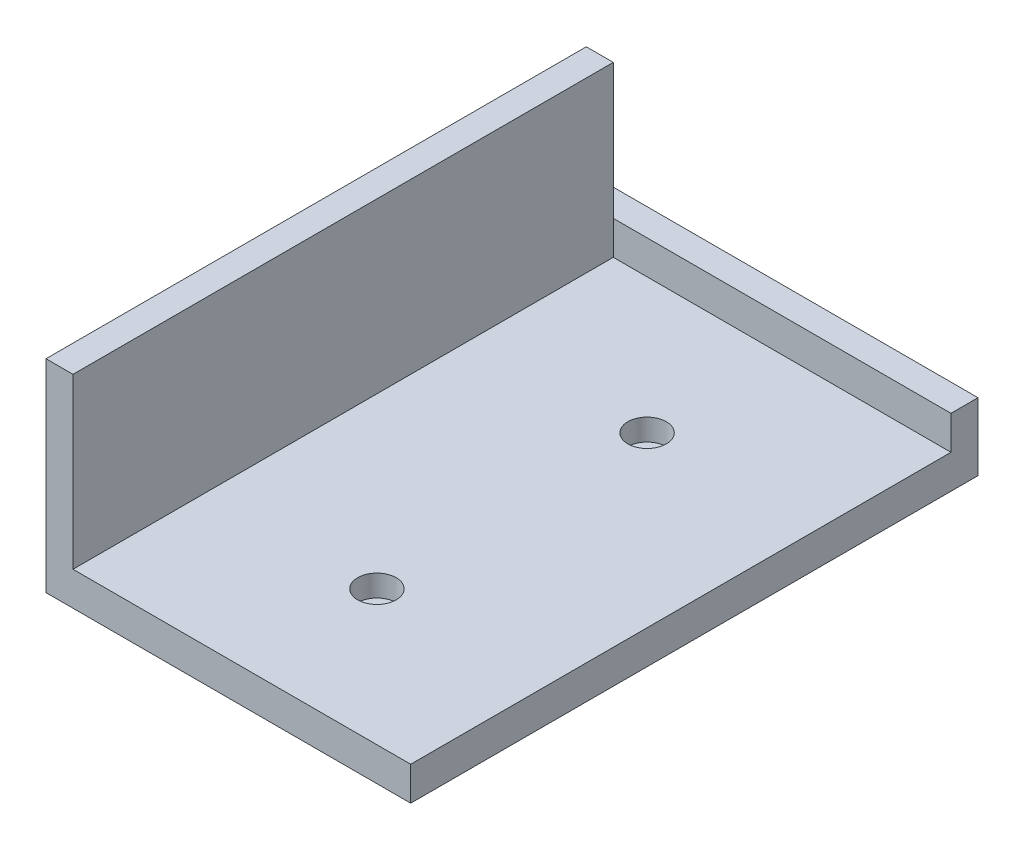
ISO-10303-21;
HEADER;
FILE_DESCRIPTION(('STEP AP214'),'2;1');
FILE_NAME('part.step','',(''),(''),'','','');
FILE_SCHEMA(('AUTOMOTIVE_DESIGN { 1 0 10303 214 1 1 1 1 }'));
ENDSEC;
DATA;
#1=APPLICATION_CONTEXT('core data for automotive mechanical design processes');
#2=APPLICATION_PROTOCOL_DEFINITION('international standard','automotive_design',2000,#1);
#3=PRODUCT_CONTEXT('',#1,'mechanical');
#4=PRODUCT('Part','Part','',(#3));
#5=PRODUCT_RELATED_PRODUCT_CATEGORY('part','',(#4));
#6=PRODUCT_DEFINITION_FORMATION('','',#4);
#7=PRODUCT_DEFINITION_CONTEXT('part definition',#1,'design');
#8=PRODUCT_DEFINITION('design','',#6,#7);
#9=PRODUCT_DEFINITION_SHAPE('','',#8);
#10=(LENGTH_UNIT() NAMED_UNIT(*) SI_UNIT(.MILLI.,.METRE.));
#11=(NAMED_UNIT(*) PLANE_ANGLE_UNIT() SI_UNIT($,.RADIAN.));
#12=(NAMED_UNIT(*) SI_UNIT($,.STERADIAN.) SOLID_ANGLE_UNIT());
#13=UNCERTAINTY_MEASURE_WITH_UNIT(LENGTH_MEASURE(1.E-05),#10,'distance_accuracy_value','');
#14=(GEOMETRIC_REPRESENTATION_CONTEXT(3) GLOBAL_UNCERTAINTY_ASSIGNED_CONTEXT((#13)) GLOBAL_UNIT_ASSIGNED_CONTEXT((#10,
#11,#12)) REPRESENTATION_CONTEXT('',''));
#15=CARTESIAN_POINT('',(0.,0.,0.));
#16=DIRECTION('',(0.,0.,1.));
#17=DIRECTION('',(1.,0.,0.));
#18=AXIS2_PLACEMENT_3D('',#15,#16,#17);
#19=CARTESIAN_POINT('',(-1.49532710280374,5.,0.));
#20=DIRECTION('',(1.,0.,0.));
#21=DIRECTION('',(0.,0.,-1.));
#22=AXIS2_PLACEMENT_3D('',#19,#20,#21);
#23=PLANE('',#22);
#24=DIRECTION('',(0.,0.,1.));
#25=VECTOR('',#24,1.);
#26=CARTESIAN_POINT('',(-1.49532710280374,0.,0.));
#27=LINE('',#26,#25);
#28=CARTESIAN_POINT('',(-1.49532710280375,0.,-39.7632398753894));
#29=VERTEX_POINT('',#28);
#30=CARTESIAN_POINT('',(-1.49532710280374,0.,44.2367601246106));
#31=VERTEX_POINT('',#30);
#32=EDGE_CURVE('E160',#29,#31,#27,.T.);
#33=ORIENTED_EDGE('',*,*,#32,.F.);
#34=DIRECTION('',(0.,-1.,0.));
#35=VECTOR('',#34,1.);
#36=CARTESIAN_POINT('',(-1.49532710280375,10.,-39.7632398753894));
#37=LINE('',#36,#35);
#38=CARTESIAN_POINT('',(-1.49532710280375,10.,-39.7632398753894));
#39=VERTEX_POINT('',#38);
#40=EDGE_CURVE('E149',#39,#29,#37,.T.);
#41=ORIENTED_EDGE('',*,*,#40,.F.);
#42=DIRECTION('',(0.,0.,1.));
#43=VECTOR('',#42,1.);
#44=CARTESIAN_POINT('',(-1.49532710280365,10.,0.));
#45=LINE('',#44,#43);
#46=CARTESIAN_POINT('',(-1.49532710280374,10.,-35.7632398753894));
#47=VERTEX_POINT('',#46);
#48=EDGE_CURVE('E147',#39,#47,#45,.T.);
#49=ORIENTED_EDGE('',*,*,#48,.T.);
#50=DIRECTION('',(0.,-1.,0.));
#51=VECTOR('',#50,1.);
#52=CARTESIAN_POINT('',(-1.49532710280374,10.,-35.7632398753894));
#53=LINE('',#52,#51);
#54=CARTESIAN_POINT('',(-1.49532710280374,5.,-35.7632398753894));
#55=VERTEX_POINT('',#54);
#56=EDGE_CURVE('E154',#47,#55,#53,.T.);
#57=ORIENTED_EDGE('',*,*,#56,.T.);
#58=DIRECTION('',(0.,0.,1.));
#59=VECTOR('',#58,1.);
#60=CARTESIAN_POINT('',(-1.49532710280374,5.,0.));
#61=LINE('',#60,#59);
#62=CARTESIAN_POINT('',(-1.49532710280374,5.,44.2367601246106));
#63=VERTEX_POINT('',#62);
#64=EDGE_CURVE('E72',#55,#63,#61,.T.);
#65=ORIENTED_EDGE('',*,*,#64,.T.);
#66=DIRECTION('',(0.,-1.,0.));
#67=VECTOR('',#66,1.);
#68=CARTESIAN_POINT('',(-1.49532710280374,5.,44.2367601246106));
#69=LINE('',#68,#67);
#70=EDGE_CURVE('E11',#63,#31,#69,.T.);
#71=ORIENTED_EDGE('',*,*,#70,.T.);
#72=EDGE_LOOP('',(#33,#41,#49,#57,#65,#71));
#73=FACE_BOUND('',#72,.T.);
#74=ADVANCED_FACE('F35',(#73),#23,.T.);
#75=CARTESIAN_POINT('',(0.,5.,44.2367601246106));
#76=DIRECTION('',(0.,0.,-1.));
#77=DIRECTION('',(-1.,0.,0.));
#78=AXIS2_PLACEMENT_3D('',#75,#76,#77);
#79=PLANE('',#78);
#80=DIRECTION('',(1.,0.,0.));
#81=VECTOR('',#80,1.);
#82=CARTESIAN_POINT('',(0.,0.,44.2367601246106));
#83=LINE('',#82,#81);
#84=CARTESIAN_POINT('',(-55.4953271028037,0.,44.2367601246106));
#85=VERTEX_POINT('',#84);
#86=EDGE_CURVE('E163',#85,#31,#83,.T.);
#87=ORIENTED_EDGE('',*,*,#86,.T.);
#88=ORIENTED_EDGE('',*,*,#70,.F.);
#89=DIRECTION('',(1.,0.,0.));
#90=VECTOR('',#89,1.);
#91=CARTESIAN_POINT('',(0.,5.,44.2367601246106));
#92=LINE('',#91,#90);
#93=CARTESIAN_POINT('',(-51.4953271028037,5.,44.2367601246106));
#94=VERTEX_POINT('',#93);
#95=EDGE_CURVE('E42',#94,#63,#92,.T.);
#96=ORIENTED_EDGE('',*,*,#95,.F.);
#97=DIRECTION('',(0.,-1.,0.));
#98=VECTOR('',#97,1.);
#99=CARTESIAN_POINT('',(-51.4953271028037,30.,44.2367601246106));
#100=LINE('',#99,#98);
#101=CARTESIAN_POINT('',(-51.4953271028037,30.,44.2367601246106));
#102=VERTEX_POINT('',#101);
#103=EDGE_CURVE('E136',#102,#94,#100,.T.);
#104=ORIENTED_EDGE('',*,*,#103,.F.);
#105=DIRECTION('',(-1.,0.,0.));
#106=VECTOR('',#105,1.);
#107=CARTESIAN_POINT('',(0.,30.,44.2367601246106));
#108=LINE('',#107,#106);
#109=CARTESIAN_POINT('',(-55.4953271028037,30.,44.2367601246106));
#110=VERTEX_POINT('',#109);
#111=EDGE_CURVE('E118',#102,#110,#108,.T.);
#112=ORIENTED_EDGE('',*,*,#111,.T.);
#113=DIRECTION('',(0.,-1.,0.));
#114=VECTOR('',#113,1.);
#115=CARTESIAN_POINT('',(-55.4953271028037,30.,44.2367601246106));
#116=LINE('',#115,#114);
#117=EDGE_CURVE('E114',#110,#85,#116,.T.);
#118=ORIENTED_EDGE('',*,*,#117,.T.);
#119=EDGE_LOOP('',(#87,#88,#96,#104,#112,#118));
#120=FACE_BOUND('',#119,.T.);
#121=ADVANCED_FACE('F170',(#120),#79,.F.);
#122=CARTESIAN_POINT('',(0.,5.,0.));
#123=DIRECTION('',(0.,1.,0.));
#124=DIRECTION('',(0.,0.,1.));
#125=AXIS2_PLACEMENT_3D('',#122,#123,#124);
#126=PLANE('',#125);
#127=CARTESIAN_POINT('',(-26.4953271028037,5.,-15.7632398753894));
#128=DIRECTION('',(0.,1.,0.));
#129=DIRECTION('',(0.,0.,1.));
#130=AXIS2_PLACEMENT_3D('',#127,#128,#129);
#131=CIRCLE('',#130,2.84999999999999);
#132=CARTESIAN_POINT('',(-26.4953271028037,5.,-12.9132398753894));
#133=VERTEX_POINT('',#132);
#134=EDGE_CURVE('E214',#133,#133,#131,.T.);
#135=ORIENTED_EDGE('',*,*,#134,.F.);
#136=EDGE_LOOP('',(#135));
#137=FACE_BOUND('',#136,.T.);
#138=CARTESIAN_POINT('',(-26.4953271028037,5.,24.2367601246106));
#139=DIRECTION('',(0.,1.,0.));
#140=DIRECTION('',(0.,0.,1.));
#141=AXIS2_PLACEMENT_3D('',#138,#139,#140);
#142=CIRCLE('',#141,2.84999999999999);
#143=CARTESIAN_POINT('',(-26.4953271028037,5.,27.0867601246106));
#144=VERTEX_POINT('',#143);
#145=EDGE_CURVE('E202',#144,#144,#142,.T.);
#146=ORIENTED_EDGE('',*,*,#145,.F.);
#147=EDGE_LOOP('',(#146));
#148=FACE_BOUND('',#147,.T.);
#149=ORIENTED_EDGE('',*,*,#64,.F.);
#150=DIRECTION('',(1.,0.,0.));
#151=VECTOR('',#150,1.);
#152=CARTESIAN_POINT('',(0.,5.,-35.7632398753894));
#153=LINE('',#152,#151);
#154=CARTESIAN_POINT('',(-51.4953271028038,5.,-35.7632398753894));
#155=VERTEX_POINT('',#154);
#156=EDGE_CURVE('E162',#155,#55,#153,.T.);
#157=ORIENTED_EDGE('',*,*,#156,.F.);
#158=DIRECTION('',(0.,0.,1.));
#159=VECTOR('',#158,1.);
#160=CARTESIAN_POINT('',(-51.4953271028037,5.,0.));
#161=LINE('',#160,#159);
#162=EDGE_CURVE('E165',#155,#94,#161,.T.);
#163=ORIENTED_EDGE('',*,*,#162,.T.);
#164=ORIENTED_EDGE('',*,*,#95,.T.);
#165=EDGE_LOOP('',(#149,#157,#163,#164));
#166=FACE_BOUND('',#165,.T.);
#167=ADVANCED_FACE('F185',(#137,#148,#166),#126,.T.);
#168=CARTESIAN_POINT('',(0.,0.,0.));
#169=DIRECTION('',(0.,1.,0.));
#170=DIRECTION('',(0.,0.,1.));
#171=AXIS2_PLACEMENT_3D('',#168,#169,#170);
#172=PLANE('',#171);
#173=CARTESIAN_POINT('',(-26.4953271028037,0.,-15.7632398753894));
#174=DIRECTION('',(0.,1.,0.));
#175=DIRECTION('',(0.,0.,1.));
#176=AXIS2_PLACEMENT_3D('',#173,#174,#175);
#177=CIRCLE('',#176,1.50000000000001);
#178=CARTESIAN_POINT('',(-26.4953271028037,0.,-14.2632398753894));
#179=VERTEX_POINT('',#178);
#180=EDGE_CURVE('E205',#179,#179,#177,.T.);
#181=ORIENTED_EDGE('',*,*,#180,.T.);
#182=EDGE_LOOP('',(#181));
#183=FACE_BOUND('',#182,.T.);
#184=CARTESIAN_POINT('',(-26.4953271028037,0.,24.2367601246106));
#185=DIRECTION('',(0.,1.,0.));
#186=DIRECTION('',(0.,0.,1.));
#187=AXIS2_PLACEMENT_3D('',#184,#185,#186);
#188=CIRCLE('',#187,1.50000000000001);
#189=CARTESIAN_POINT('',(-26.4953271028037,0.,25.7367601246106));
#190=VERTEX_POINT('',#189);
#191=EDGE_CURVE('E128',#190,#190,#188,.T.);
#192=ORIENTED_EDGE('',*,*,#191,.T.);
#193=EDGE_LOOP('',(#192));
#194=FACE_BOUND('',#193,.T.);
#195=ORIENTED_EDGE('',*,*,#86,.F.);
#196=DIRECTION('',(0.,0.,1.));
#197=VECTOR('',#196,1.);
#198=CARTESIAN_POINT('',(-55.4953271028038,0.,0.));
#199=LINE('',#198,#197);
#200=CARTESIAN_POINT('',(-55.4953271028038,0.,-39.7632398753894));
#201=VERTEX_POINT('',#200);
#202=EDGE_CURVE('E134',#201,#85,#199,.T.);
#203=ORIENTED_EDGE('',*,*,#202,.F.);
#204=DIRECTION('',(-1.,0.,0.));
#205=VECTOR('',#204,1.);
#206=CARTESIAN_POINT('',(0.,0.,-39.7632398753894));
#207=LINE('',#206,#205);
#208=EDGE_CURVE('E131',#29,#201,#207,.T.);
#209=ORIENTED_EDGE('',*,*,#208,.F.);
#210=ORIENTED_EDGE('',*,*,#32,.T.);
#211=EDGE_LOOP('',(#195,#203,#209,#210));
#212=FACE_BOUND('',#211,.T.);
#213=ADVANCED_FACE('F173',(#183,#194,#212),#172,.F.);
#214=CARTESIAN_POINT('',(0.,10.,-35.7632398753894));
#215=DIRECTION('',(0.,0.,1.));
#216=DIRECTION('',(1.,0.,0.));
#217=AXIS2_PLACEMENT_3D('',#214,#215,#216);
#218=PLANE('',#217);
#219=DIRECTION('',(0.,-1.,0.));
#220=VECTOR('',#219,1.);
#221=CARTESIAN_POINT('',(-51.4953271028038,30.,-35.7632398753894));
#222=LINE('',#221,#220);
#223=CARTESIAN_POINT('',(-51.4953271028038,10.,-35.7632398753894));
#224=VERTEX_POINT('',#223);
#225=EDGE_CURVE('E183',#224,#155,#222,.T.);
#226=ORIENTED_EDGE('',*,*,#225,.T.);
#227=ORIENTED_EDGE('',*,*,#156,.T.);
#228=ORIENTED_EDGE('',*,*,#56,.F.);
#229=DIRECTION('',(-1.,0.,0.));
#230=VECTOR('',#229,1.);
#231=CARTESIAN_POINT('',(0.,10.,-35.7632398753894));
#232=LINE('',#231,#230);
#233=EDGE_CURVE('E145',#47,#224,#232,.T.);
#234=ORIENTED_EDGE('',*,*,#233,.T.);
#235=EDGE_LOOP('',(#226,#227,#228,#234));
#236=FACE_BOUND('',#235,.T.);
#237=ADVANCED_FACE('F181',(#236),#218,.T.);
#238=CARTESIAN_POINT('',(0.,10.,-39.7632398753894));
#239=DIRECTION('',(0.,0.,1.));
#240=DIRECTION('',(1.,0.,0.));
#241=AXIS2_PLACEMENT_3D('',#238,#239,#240);
#242=PLANE('',#241);
#243=ORIENTED_EDGE('',*,*,#208,.T.);
#244=DIRECTION('',(0.,-1.,0.));
#245=VECTOR('',#244,1.);
#246=CARTESIAN_POINT('',(-55.4953271028038,10.,-39.7632398753894));
#247=LINE('',#246,#245);
#248=CARTESIAN_POINT('',(-55.4953271028038,10.,-39.7632398753894));
#249=VERTEX_POINT('',#248);
#250=EDGE_CURVE('E157',#249,#201,#247,.T.);
#251=ORIENTED_EDGE('',*,*,#250,.F.);
#252=DIRECTION('',(-1.,0.,0.));
#253=VECTOR('',#252,1.);
#254=CARTESIAN_POINT('',(0.,10.,-39.7632398753894));
#255=LINE('',#254,#253);
#256=EDGE_CURVE('E140',#39,#249,#255,.T.);
#257=ORIENTED_EDGE('',*,*,#256,.F.);
#258=ORIENTED_EDGE('',*,*,#40,.T.);
#259=EDGE_LOOP('',(#243,#251,#257,#258));
#260=FACE_BOUND('',#259,.T.);
#261=ADVANCED_FACE('F176',(#260),#242,.F.);
#262=CARTESIAN_POINT('',(-55.4953271028038,10.,0.));
#263=DIRECTION('',(1.,0.,0.));
#264=DIRECTION('',(0.,0.,-1.));
#265=AXIS2_PLACEMENT_3D('',#262,#263,#264);
#266=PLANE('',#265);
#267=ORIENTED_EDGE('',*,*,#202,.T.);
#268=ORIENTED_EDGE('',*,*,#117,.F.);
#269=DIRECTION('',(0.,0.,1.));
#270=VECTOR('',#269,1.);
#271=CARTESIAN_POINT('',(-55.4953271028038,30.,0.));
#272=LINE('',#271,#270);
#273=CARTESIAN_POINT('',(-55.4953271028038,30.,-35.7632398753894));
#274=VERTEX_POINT('',#273);
#275=EDGE_CURVE('E107',#274,#110,#272,.T.);
#276=ORIENTED_EDGE('',*,*,#275,.F.);
#277=DIRECTION('',(0.,-1.,0.));
#278=VECTOR('',#277,1.);
#279=CARTESIAN_POINT('',(-55.4953271028038,30.,-35.7632398753894));
#280=LINE('',#279,#278);
#281=CARTESIAN_POINT('',(-55.4953271028038,10.,-35.7632398753894));
#282=VERTEX_POINT('',#281);
#283=EDGE_CURVE('E112',#274,#282,#280,.T.);
#284=ORIENTED_EDGE('',*,*,#283,.T.);
#285=DIRECTION('',(0.,0.,1.));
#286=VECTOR('',#285,1.);
#287=CARTESIAN_POINT('',(-55.4953271028038,10.,0.));
#288=LINE('',#287,#286);
#289=EDGE_CURVE('E143',#249,#282,#288,.T.);
#290=ORIENTED_EDGE('',*,*,#289,.F.);
#291=ORIENTED_EDGE('',*,*,#250,.T.);
#292=EDGE_LOOP('',(#267,#268,#276,#284,#290,#291));
#293=FACE_BOUND('',#292,.T.);
#294=ADVANCED_FACE('F110',(#293),#266,.F.);
#295=CARTESIAN_POINT('',(0.,10.,0.));
#296=DIRECTION('',(0.,1.,0.));
#297=DIRECTION('',(0.,0.,1.));
#298=AXIS2_PLACEMENT_3D('',#295,#296,#297);
#299=PLANE('',#298);
#300=ORIENTED_EDGE('',*,*,#256,.T.);
#301=ORIENTED_EDGE('',*,*,#289,.T.);
#302=EDGE_CURVE('E49',#224,#282,#232,.T.);
#303=ORIENTED_EDGE('',*,*,#302,.F.);
#304=ORIENTED_EDGE('',*,*,#233,.F.);
#305=ORIENTED_EDGE('',*,*,#48,.F.);
#306=EDGE_LOOP('',(#300,#301,#303,#304,#305));
#307=FACE_BOUND('',#306,.T.);
#308=ADVANCED_FACE('F179',(#307),#299,.T.);
#309=CARTESIAN_POINT('',(0.,30.,-35.7632398753894));
#310=DIRECTION('',(0.,0.,1.));
#311=DIRECTION('',(1.,0.,0.));
#312=AXIS2_PLACEMENT_3D('',#309,#310,#311);
#313=PLANE('',#312);
#314=ORIENTED_EDGE('',*,*,#302,.T.);
#315=ORIENTED_EDGE('',*,*,#283,.F.);
#316=DIRECTION('',(-1.,0.,0.));
#317=VECTOR('',#316,1.);
#318=CARTESIAN_POINT('',(0.,30.,-35.7632398753894));
#319=LINE('',#318,#317);
#320=CARTESIAN_POINT('',(-51.4953271028038,30.,-35.7632398753894));
#321=VERTEX_POINT('',#320);
#322=EDGE_CURVE('E119',#321,#274,#319,.T.);
#323=ORIENTED_EDGE('',*,*,#322,.F.);
#324=EDGE_CURVE('E189',#321,#224,#222,.T.);
#325=ORIENTED_EDGE('',*,*,#324,.T.);
#326=EDGE_LOOP('',(#314,#315,#323,#325));
#327=FACE_BOUND('',#326,.T.);
#328=ADVANCED_FACE('F130',(#327),#313,.F.);
#329=CARTESIAN_POINT('',(-51.4953271028037,30.,0.));
#330=DIRECTION('',(1.,0.,0.));
#331=DIRECTION('',(0.,0.,-1.));
#332=AXIS2_PLACEMENT_3D('',#329,#330,#331);
#333=PLANE('',#332);
#334=ORIENTED_EDGE('',*,*,#103,.T.);
#335=ORIENTED_EDGE('',*,*,#162,.F.);
#336=ORIENTED_EDGE('',*,*,#225,.F.);
#337=ORIENTED_EDGE('',*,*,#324,.F.);
#338=DIRECTION('',(0.,0.,1.));
#339=VECTOR('',#338,1.);
#340=CARTESIAN_POINT('',(-51.4953271028037,30.,0.));
#341=LINE('',#340,#339);
#342=EDGE_CURVE('E125',#321,#102,#341,.T.);
#343=ORIENTED_EDGE('',*,*,#342,.T.);
#344=EDGE_LOOP('',(#334,#335,#336,#337,#343));
#345=FACE_BOUND('',#344,.T.);
#346=ADVANCED_FACE('F188',(#345),#333,.T.);
#347=CARTESIAN_POINT('',(0.,30.,0.));
#348=DIRECTION('',(0.,1.,0.));
#349=DIRECTION('',(0.,0.,1.));
#350=AXIS2_PLACEMENT_3D('',#347,#348,#349);
#351=PLANE('',#350);
#352=ORIENTED_EDGE('',*,*,#322,.T.);
#353=ORIENTED_EDGE('',*,*,#275,.T.);
#354=ORIENTED_EDGE('',*,*,#111,.F.);
#355=ORIENTED_EDGE('',*,*,#342,.F.);
#356=EDGE_LOOP('',(#352,#353,#354,#355));
#357=FACE_BOUND('',#356,.T.);
#358=ADVANCED_FACE('F123',(#357),#351,.T.);
#359=CARTESIAN_POINT('',(-26.4953271028037,5.,24.2367601246106));
#360=DIRECTION('',(0.,1.,0.));
#361=DIRECTION('',(0.,0.,1.));
#362=AXIS2_PLACEMENT_3D('',#359,#360,#361);
#363=CYLINDRICAL_SURFACE('',#362,1.50000000000001);
#364=ORIENTED_EDGE('',*,*,#191,.F.);
#365=EDGE_LOOP('',(#364));
#366=FACE_BOUND('',#365,.T.);
#367=CARTESIAN_POINT('',(-26.4953271028037,1.8,24.2367601246106));
#368=DIRECTION('',(0.,1.,0.));
#369=DIRECTION('',(0.,0.,1.));
#370=AXIS2_PLACEMENT_3D('',#367,#368,#369);
#371=CIRCLE('',#370,1.5);
#372=CARTESIAN_POINT('',(-26.4953271028037,1.8,25.7367601246106));
#373=VERTEX_POINT('',#372);
#374=EDGE_CURVE('E196',#373,#373,#371,.T.);
#375=ORIENTED_EDGE('',*,*,#374,.T.);
#376=EDGE_LOOP('',(#375));
#377=FACE_BOUND('',#376,.T.);
#378=ADVANCED_FACE('F238',(#366,#377),#363,.F.);
#379=CARTESIAN_POINT('',(-24.9953271028037,1.8,24.2367601246106));
#380=DIRECTION('',(0.,-1.,0.));
#381=DIRECTION('',(0.,0.,-1.));
#382=AXIS2_PLACEMENT_3D('',#379,#380,#381);
#383=PLANE('',#382);
#384=ORIENTED_EDGE('',*,*,#374,.F.);
#385=EDGE_LOOP('',(#384));
#386=FACE_BOUND('',#385,.T.);
#387=CARTESIAN_POINT('',(-26.4953271028037,1.8,24.2367601246106));
#388=DIRECTION('',(0.,1.,0.));
#389=DIRECTION('',(0.,0.,1.));
#390=AXIS2_PLACEMENT_3D('',#387,#388,#389);
#391=CIRCLE('',#390,2.85);
#392=CARTESIAN_POINT('',(-26.4953271028037,1.8,27.0867601246106));
#393=VERTEX_POINT('',#392);
#394=EDGE_CURVE('E199',#393,#393,#391,.T.);
#395=ORIENTED_EDGE('',*,*,#394,.T.);
#396=EDGE_LOOP('',(#395));
#397=FACE_BOUND('',#396,.T.);
#398=ADVANCED_FACE('F228',(#386,#397),#383,.F.);
#399=CARTESIAN_POINT('',(-26.4953271028037,5.,24.2367601246106));
#400=DIRECTION('',(0.,1.,0.));
#401=DIRECTION('',(0.,0.,1.));
#402=AXIS2_PLACEMENT_3D('',#399,#400,#401);
#403=CYLINDRICAL_SURFACE('',#402,2.85);
#404=ORIENTED_EDGE('',*,*,#394,.F.);
#405=EDGE_LOOP('',(#404));
#406=FACE_BOUND('',#405,.T.);
#407=ORIENTED_EDGE('',*,*,#145,.T.);
#408=EDGE_LOOP('',(#407));
#409=FACE_BOUND('',#408,.T.);
#410=ADVANCED_FACE('F225',(#406,#409),#403,.F.);
#411=CARTESIAN_POINT('',(-26.4953271028037,5.,-15.7632398753894));
#412=DIRECTION('',(0.,1.,0.));
#413=DIRECTION('',(0.,0.,1.));
#414=AXIS2_PLACEMENT_3D('',#411,#412,#413);
#415=CYLINDRICAL_SURFACE('',#414,1.50000000000001);
#416=ORIENTED_EDGE('',*,*,#180,.F.);
#417=EDGE_LOOP('',(#416));
#418=FACE_BOUND('',#417,.T.);
#419=CARTESIAN_POINT('',(-26.4953271028037,1.8,-15.7632398753894));
#420=DIRECTION('',(0.,1.,0.));
#421=DIRECTION('',(0.,0.,1.));
#422=AXIS2_PLACEMENT_3D('',#419,#420,#421);
#423=CIRCLE('',#422,1.5);
#424=CARTESIAN_POINT('',(-26.4953271028037,1.8,-14.2632398753894));
#425=VERTEX_POINT('',#424);
#426=EDGE_CURVE('E208',#425,#425,#423,.T.);
#427=ORIENTED_EDGE('',*,*,#426,.T.);
#428=EDGE_LOOP('',(#427));
#429=FACE_BOUND('',#428,.T.);
#430=ADVANCED_FACE('F227',(#418,#429),#415,.F.);
#431=CARTESIAN_POINT('',(-24.9953271028037,1.8,-15.7632398753894));
#432=DIRECTION('',(0.,-1.,0.));
#433=DIRECTION('',(0.,0.,-1.));
#434=AXIS2_PLACEMENT_3D('',#431,#432,#433);
#435=PLANE('',#434);
#436=ORIENTED_EDGE('',*,*,#426,.F.);
#437=EDGE_LOOP('',(#436));
#438=FACE_BOUND('',#437,.T.);
#439=CARTESIAN_POINT('',(-26.4953271028037,1.8,-15.7632398753894));
#440=DIRECTION('',(0.,1.,0.));
#441=DIRECTION('',(0.,0.,1.));
#442=AXIS2_PLACEMENT_3D('',#439,#440,#441);
#443=CIRCLE('',#442,2.85);
#444=CARTESIAN_POINT('',(-26.4953271028037,1.8,-12.9132398753894));
#445=VERTEX_POINT('',#444);
#446=EDGE_CURVE('E211',#445,#445,#443,.T.);
#447=ORIENTED_EDGE('',*,*,#446,.T.);
#448=EDGE_LOOP('',(#447));
#449=FACE_BOUND('',#448,.T.);
#450=ADVANCED_FACE('F235',(#438,#449),#435,.F.);
#451=CARTESIAN_POINT('',(-26.4953271028037,5.,-15.7632398753894));
#452=DIRECTION('',(0.,1.,0.));
#453=DIRECTION('',(0.,0.,1.));
#454=AXIS2_PLACEMENT_3D('',#451,#452,#453);
#455=CYLINDRICAL_SURFACE('',#454,2.85);
#456=ORIENTED_EDGE('',*,*,#446,.F.);
#457=EDGE_LOOP('',(#456));
#458=FACE_BOUND('',#457,.T.);
#459=ORIENTED_EDGE('',*,*,#134,.T.);
#460=EDGE_LOOP('',(#459));
#461=FACE_BOUND('',#460,.T.);
#462=ADVANCED_FACE('F218',(#458,#461),#455,.F.);
#463=CLOSED_SHELL('',(#74,#121,#167,#213,#237,#261,#294,#308,#328,#346,#358,#378,#398,#410,#430,
#450,#462));
#464=MANIFOLD_SOLID_BREP('B2',#463);
#465=ADVANCED_BREP_SHAPE_REPRESENTATION('',(#18,#464),#14);
#466=SHAPE_DEFINITION_REPRESENTATION(#9,#465);
ENDSEC;
END-ISO-10303-21;
